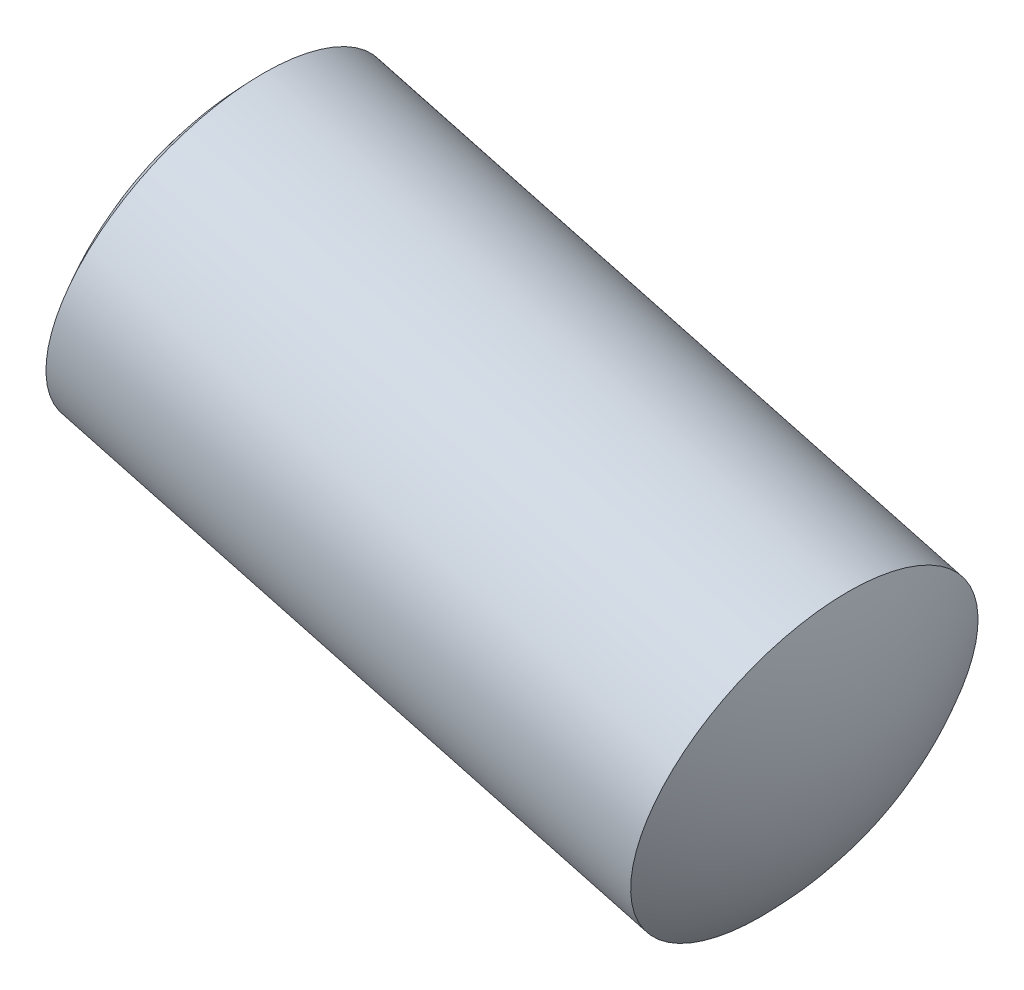
ISO-10303-21;
HEADER;
FILE_DESCRIPTION(('STEP AP214'),'2;1');
FILE_NAME('part.step','',(''),(''),'','','');
FILE_SCHEMA(('AUTOMOTIVE_DESIGN { 1 0 10303 214 1 1 1 1 }'));
ENDSEC;
DATA;
#1=APPLICATION_CONTEXT('core data for automotive mechanical design processes');
#2=APPLICATION_PROTOCOL_DEFINITION('international standard','automotive_design',2000,#1);
#3=PRODUCT_CONTEXT('',#1,'mechanical');
#4=PRODUCT('Part','Part','',(#3));
#5=PRODUCT_RELATED_PRODUCT_CATEGORY('part','',(#4));
#6=PRODUCT_DEFINITION_FORMATION('','',#4);
#7=PRODUCT_DEFINITION_CONTEXT('part definition',#1,'design');
#8=PRODUCT_DEFINITION('design','',#6,#7);
#9=PRODUCT_DEFINITION_SHAPE('','',#8);
#10=(LENGTH_UNIT() NAMED_UNIT(*) SI_UNIT(.MILLI.,.METRE.));
#11=(NAMED_UNIT(*) PLANE_ANGLE_UNIT() SI_UNIT($,.RADIAN.));
#12=(NAMED_UNIT(*) SI_UNIT($,.STERADIAN.) SOLID_ANGLE_UNIT());
#13=UNCERTAINTY_MEASURE_WITH_UNIT(LENGTH_MEASURE(1.E-05),#10,'distance_accuracy_value','');
#14=(GEOMETRIC_REPRESENTATION_CONTEXT(3) GLOBAL_UNCERTAINTY_ASSIGNED_CONTEXT((#13)) GLOBAL_UNIT_ASSIGNED_CONTEXT((#10,
#11,#12)) REPRESENTATION_CONTEXT('',''));
#15=CARTESIAN_POINT('',(0.,0.,0.));
#16=DIRECTION('',(0.,0.,1.));
#17=DIRECTION('',(1.,0.,0.));
#18=AXIS2_PLACEMENT_3D('',#15,#16,#17);
#19=CARTESIAN_POINT('',(-26.6614110427164,7.14390355797012,0.9));
#20=DIRECTION('',(0.258819045102522,0.965925826289068,0.));
#21=DIRECTION('',(-0.965925826289068,0.258819045102522,0.));
#22=AXIS2_PLACEMENT_3D('',#19,#20,#21);
#23=SPHERICAL_SURFACE('',#22,3.);
#24=CARTESIAN_POINT('',(-26.6614110427164,7.14390355797012,0.9));
#25=DIRECTION('',(0.965925826289068,-0.258819045102522,0.));
#26=DIRECTION('',(0.,0.,-1.));
#27=AXIS2_PLACEMENT_3D('',#24,#25,#26);
#28=SPHERICAL_SURFACE('',#27,3.);
#29=CARTESIAN_POINT('',(-29.1709599539299,7.81633516209612,0.9));
#30=DIRECTION('',(0.965925826289068,-0.258819045102522,0.));
#31=DIRECTION('',(0.,0.,-1.));
#32=AXIS2_PLACEMENT_3D('',#29,#30,#31);
#33=CIRCLE('',#32,1.5);
#34=CARTESIAN_POINT('',(-29.1709599539299,7.81633516209612,-0.6));
#35=VERTEX_POINT('',#34);
#36=EDGE_CURVE('E11',#35,#35,#33,.T.);
#37=ORIENTED_EDGE('',*,*,#36,.F.);
#38=EDGE_LOOP('',(#37));
#39=FACE_BOUND('',#38,.T.);
#40=ADVANCED_FACE('F17',(#39),#28,.T.);
#41=CARTESIAN_POINT('',(-26.4645094031823,7.09114392266852,0.9));
#42=DIRECTION('',(0.258819045102522,0.965925826289068,0.));
#43=DIRECTION('',(0.965925826289068,-0.258819045102522,0.));
#44=AXIS2_PLACEMENT_3D('',#41,#42,#43);
#45=SPHERICAL_SURFACE('',#44,3.);
#46=CARTESIAN_POINT('',(-26.4645094031823,7.09114392266852,0.9));
#47=DIRECTION('',(0.965925826289068,-0.258819045102522,0.));
#48=DIRECTION('',(0.,0.,-1.));
#49=AXIS2_PLACEMENT_3D('',#46,#47,#48);
#50=SPHERICAL_SURFACE('',#49,3.);
#51=CARTESIAN_POINT('',(-23.9549604919689,6.41871231854252,0.9));
#52=DIRECTION('',(0.965925826289068,-0.258819045102522,0.));
#53=DIRECTION('',(0.,0.,-1.));
#54=AXIS2_PLACEMENT_3D('',#51,#52,#53);
#55=CIRCLE('',#54,1.5);
#56=CARTESIAN_POINT('',(-23.9549604919689,6.41871231854252,-0.6));
#57=VERTEX_POINT('',#56);
#58=EDGE_CURVE('E21',#57,#57,#55,.T.);
#59=ORIENTED_EDGE('',*,*,#58,.T.);
#60=EDGE_LOOP('',(#59));
#61=FACE_BOUND('',#60,.T.);
#62=ADVANCED_FACE('F19',(#61),#50,.T.);
#63=CARTESIAN_POINT('',(-25.2589603574591,6.76811802943089,0.9));
#64=DIRECTION('',(0.965925826289068,-0.258819045102522,0.));
#65=DIRECTION('',(0.,0.,-1.));
#66=AXIS2_PLACEMENT_3D('',#63,#64,#65);
#67=CYLINDRICAL_SURFACE('',#66,1.5);
#68=ORIENTED_EDGE('',*,*,#36,.T.);
#69=EDGE_LOOP('',(#68));
#70=FACE_BOUND('',#69,.T.);
#71=ORIENTED_EDGE('',*,*,#58,.F.);
#72=EDGE_LOOP('',(#71));
#73=FACE_BOUND('',#72,.T.);
#74=ADVANCED_FACE('F57',(#70,#73),#67,.T.);
#75=CLOSED_SHELL('',(#40,#62,#74));
#76=MANIFOLD_SOLID_BREP('B1',#75);
#77=ADVANCED_BREP_SHAPE_REPRESENTATION('',(#18,#76),#14);
#78=SHAPE_DEFINITION_REPRESENTATION(#9,#77);
ENDSEC;
END-ISO-10303-21;
